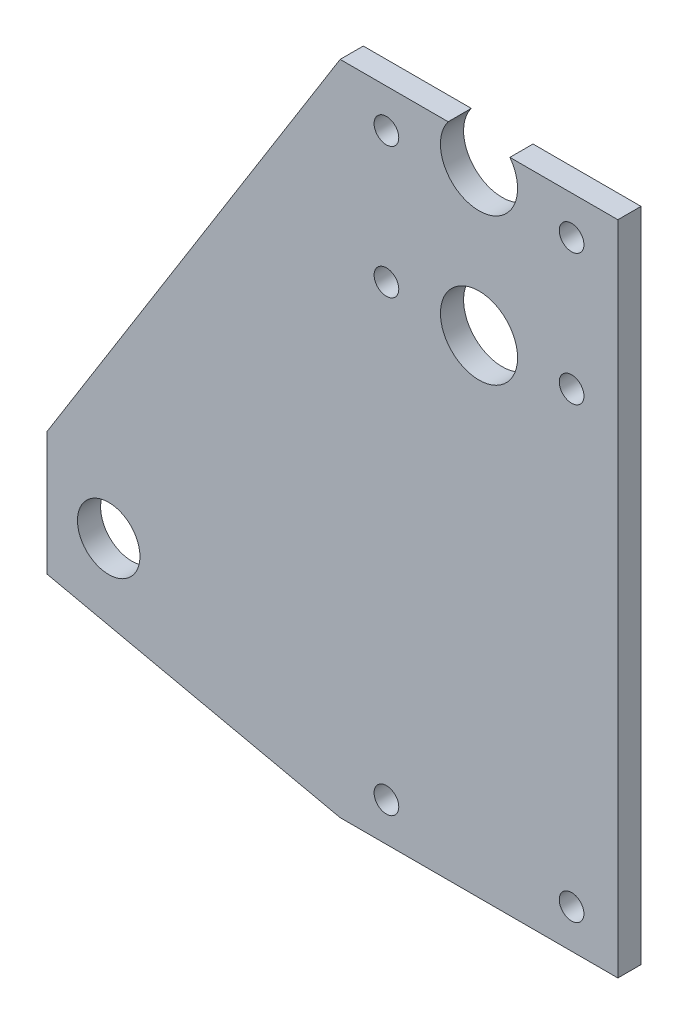
ISO-10303-21;
HEADER;
FILE_DESCRIPTION(('STEP AP214'),'2;1');
FILE_NAME('part.step','',(''),(''),'','','');
FILE_SCHEMA(('AUTOMOTIVE_DESIGN { 1 0 10303 214 1 1 1 1 }'));
ENDSEC;
DATA;
#1=APPLICATION_CONTEXT('core data for automotive mechanical design processes');
#2=APPLICATION_PROTOCOL_DEFINITION('international standard','automotive_design',2000,#1);
#3=PRODUCT_CONTEXT('',#1,'mechanical');
#4=PRODUCT('Part','Part','',(#3));
#5=PRODUCT_RELATED_PRODUCT_CATEGORY('part','',(#4));
#6=PRODUCT_DEFINITION_FORMATION('','',#4);
#7=PRODUCT_DEFINITION_CONTEXT('part definition',#1,'design');
#8=PRODUCT_DEFINITION('design','',#6,#7);
#9=PRODUCT_DEFINITION_SHAPE('','',#8);
#10=(LENGTH_UNIT() NAMED_UNIT(*) SI_UNIT(.MILLI.,.METRE.));
#11=(NAMED_UNIT(*) PLANE_ANGLE_UNIT() SI_UNIT($,.RADIAN.));
#12=(NAMED_UNIT(*) SI_UNIT($,.STERADIAN.) SOLID_ANGLE_UNIT());
#13=UNCERTAINTY_MEASURE_WITH_UNIT(LENGTH_MEASURE(1.E-05),#10,'distance_accuracy_value','');
#14=(GEOMETRIC_REPRESENTATION_CONTEXT(3) GLOBAL_UNCERTAINTY_ASSIGNED_CONTEXT((#13)) GLOBAL_UNIT_ASSIGNED_CONTEXT((#10,
#11,#12)) REPRESENTATION_CONTEXT('',''));
#15=CARTESIAN_POINT('',(0.,0.,0.));
#16=DIRECTION('',(0.,0.,1.));
#17=DIRECTION('',(1.,0.,0.));
#18=AXIS2_PLACEMENT_3D('',#15,#16,#17);
#19=CARTESIAN_POINT('',(56.,95.7795376342654,-3.));
#20=DIRECTION('',(0.,0.,1.));
#21=DIRECTION('',(1.,0.,0.));
#22=AXIS2_PLACEMENT_3D('',#19,#20,#21);
#23=CYLINDRICAL_SURFACE('',#22,5.);
#24=CARTESIAN_POINT('',(56.,95.7795376342654,0.));
#25=DIRECTION('',(0.,0.,1.));
#26=DIRECTION('',(1.,0.,0.));
#27=AXIS2_PLACEMENT_3D('',#24,#25,#26);
#28=CIRCLE('',#27,5.);
#29=CARTESIAN_POINT('',(52.,98.7795376342654,0.));
#30=VERTEX_POINT('',#29);
#31=CARTESIAN_POINT('',(60.,98.7795376342654,0.));
#32=VERTEX_POINT('',#31);
#33=EDGE_CURVE('E159',#30,#32,#28,.T.);
#34=ORIENTED_EDGE('',*,*,#33,.T.);
#35=DIRECTION('',(0.,0.,1.));
#36=VECTOR('',#35,1.);
#37=CARTESIAN_POINT('',(60.,98.7795376342654,-3.));
#38=LINE('',#37,#36);
#39=CARTESIAN_POINT('',(60.,98.7795376342654,-3.));
#40=VERTEX_POINT('',#39);
#41=EDGE_CURVE('E11',#40,#32,#38,.T.);
#42=ORIENTED_EDGE('',*,*,#41,.F.);
#43=CARTESIAN_POINT('',(56.,95.7795376342654,-3.));
#44=DIRECTION('',(0.,0.,1.));
#45=DIRECTION('',(1.,0.,0.));
#46=AXIS2_PLACEMENT_3D('',#43,#44,#45);
#47=CIRCLE('',#46,5.);
#48=CARTESIAN_POINT('',(52.,98.7795376342654,-3.));
#49=VERTEX_POINT('',#48);
#50=EDGE_CURVE('E56',#49,#40,#47,.T.);
#51=ORIENTED_EDGE('',*,*,#50,.F.);
#52=DIRECTION('',(0.,0.,1.));
#53=VECTOR('',#52,1.);
#54=CARTESIAN_POINT('',(52.,98.7795376342654,-3.));
#55=LINE('',#54,#53);
#56=EDGE_CURVE('E41',#49,#30,#55,.T.);
#57=ORIENTED_EDGE('',*,*,#56,.T.);
#58=EDGE_LOOP('',(#34,#42,#51,#57));
#59=FACE_BOUND('',#58,.T.);
#60=ADVANCED_FACE('F37',(#59),#23,.F.);
#61=CARTESIAN_POINT('',(0.,98.7795376342654,-3.));
#62=DIRECTION('',(0.,1.,0.));
#63=DIRECTION('',(0.,0.,1.));
#64=AXIS2_PLACEMENT_3D('',#61,#62,#63);
#65=PLANE('',#64);
#66=DIRECTION('',(-1.,0.,0.));
#67=VECTOR('',#66,1.);
#68=CARTESIAN_POINT('',(0.,98.7795376342654,0.));
#69=LINE('',#68,#67);
#70=CARTESIAN_POINT('',(74.,98.7795376342654,0.));
#71=VERTEX_POINT('',#70);
#72=EDGE_CURVE('E165',#71,#32,#69,.T.);
#73=ORIENTED_EDGE('',*,*,#72,.F.);
#74=DIRECTION('',(0.,0.,1.));
#75=VECTOR('',#74,1.);
#76=CARTESIAN_POINT('',(74.,98.7795376342654,-3.));
#77=LINE('',#76,#75);
#78=CARTESIAN_POINT('',(74.,98.7795376342654,-3.));
#79=VERTEX_POINT('',#78);
#80=EDGE_CURVE('E47',#79,#71,#77,.T.);
#81=ORIENTED_EDGE('',*,*,#80,.F.);
#82=DIRECTION('',(-1.,0.,0.));
#83=VECTOR('',#82,1.);
#84=CARTESIAN_POINT('',(0.,98.7795376342654,-3.));
#85=LINE('',#84,#83);
#86=EDGE_CURVE('E126',#79,#40,#85,.T.);
#87=ORIENTED_EDGE('',*,*,#86,.T.);
#88=ORIENTED_EDGE('',*,*,#41,.T.);
#89=EDGE_LOOP('',(#73,#81,#87,#88));
#90=FACE_BOUND('',#89,.T.);
#91=ADVANCED_FACE('F216',(#90),#65,.T.);
#92=CARTESIAN_POINT('',(74.,0.,-3.));
#93=DIRECTION('',(1.,0.,0.));
#94=DIRECTION('',(0.,1.,0.));
#95=AXIS2_PLACEMENT_3D('',#92,#93,#94);
#96=PLANE('',#95);
#97=DIRECTION('',(0.,1.,0.));
#98=VECTOR('',#97,1.);
#99=CARTESIAN_POINT('',(74.,0.,0.));
#100=LINE('',#99,#98);
#101=CARTESIAN_POINT('',(74.,13.6572243798793,0.));
#102=VERTEX_POINT('',#101);
#103=EDGE_CURVE('E113',#102,#71,#100,.T.);
#104=ORIENTED_EDGE('',*,*,#103,.F.);
#105=DIRECTION('',(0.,0.,1.));
#106=VECTOR('',#105,1.);
#107=CARTESIAN_POINT('',(74.,13.6572243798793,-3.));
#108=LINE('',#107,#106);
#109=CARTESIAN_POINT('',(74.,13.6572243798793,-3.));
#110=VERTEX_POINT('',#109);
#111=EDGE_CURVE('E109',#110,#102,#108,.T.);
#112=ORIENTED_EDGE('',*,*,#111,.F.);
#113=DIRECTION('',(0.,1.,0.));
#114=VECTOR('',#113,1.);
#115=CARTESIAN_POINT('',(74.,0.,-3.));
#116=LINE('',#115,#114);
#117=EDGE_CURVE('E112',#110,#79,#116,.T.);
#118=ORIENTED_EDGE('',*,*,#117,.T.);
#119=ORIENTED_EDGE('',*,*,#80,.T.);
#120=EDGE_LOOP('',(#104,#112,#118,#119));
#121=FACE_BOUND('',#120,.T.);
#122=ADVANCED_FACE('F111',(#121),#96,.T.);
#123=CARTESIAN_POINT('',(0.,13.6572243798793,-3.));
#124=DIRECTION('',(0.,-1.,0.));
#125=DIRECTION('',(0.,0.,-1.));
#126=AXIS2_PLACEMENT_3D('',#123,#124,#125);
#127=PLANE('',#126);
#128=DIRECTION('',(1.,0.,0.));
#129=VECTOR('',#128,1.);
#130=CARTESIAN_POINT('',(0.,13.6572243798793,0.));
#131=LINE('',#130,#129);
#132=CARTESIAN_POINT('',(38.,13.6572243798794,0.));
#133=VERTEX_POINT('',#132);
#134=EDGE_CURVE('E174',#133,#102,#131,.T.);
#135=ORIENTED_EDGE('',*,*,#134,.F.);
#136=DIRECTION('',(0.,0.,1.));
#137=VECTOR('',#136,1.);
#138=CARTESIAN_POINT('',(38.,13.6572243798794,-3.));
#139=LINE('',#138,#137);
#140=CARTESIAN_POINT('',(38.,13.6572243798794,-3.));
#141=VERTEX_POINT('',#140);
#142=EDGE_CURVE('E118',#141,#133,#139,.T.);
#143=ORIENTED_EDGE('',*,*,#142,.F.);
#144=DIRECTION('',(1.,0.,0.));
#145=VECTOR('',#144,1.);
#146=CARTESIAN_POINT('',(0.,13.6572243798793,-3.));
#147=LINE('',#146,#145);
#148=EDGE_CURVE('E124',#141,#110,#147,.T.);
#149=ORIENTED_EDGE('',*,*,#148,.T.);
#150=ORIENTED_EDGE('',*,*,#111,.T.);
#151=EDGE_LOOP('',(#135,#143,#149,#150));
#152=FACE_BOUND('',#151,.T.);
#153=ADVANCED_FACE('F128',(#152),#127,.T.);
#154=CARTESIAN_POINT('',(4.60792259520918,20.9883456766654,-3.));
#155=DIRECTION('',(-0.214439472635752,-0.976737279198301,0.));
#156=DIRECTION('',(0.976737279198302,-0.214439472635752,0.));
#157=AXIS2_PLACEMENT_3D('',#154,#155,#156);
#158=PLANE('',#157);
#159=DIRECTION('',(0.976737279198302,-0.214439472635752,0.));
#160=VECTOR('',#159,1.);
#161=CARTESIAN_POINT('',(4.60792259520918,20.9883456766654,0.));
#162=LINE('',#161,#160);
#163=CARTESIAN_POINT('',(0.,22.,0.));
#164=VERTEX_POINT('',#163);
#165=EDGE_CURVE('E171',#164,#133,#162,.T.);
#166=ORIENTED_EDGE('',*,*,#165,.F.);
#167=DIRECTION('',(0.,0.,1.));
#168=VECTOR('',#167,1.);
#169=CARTESIAN_POINT('',(0.,22.,-3.));
#170=LINE('',#169,#168);
#171=CARTESIAN_POINT('',(0.,22.,-3.));
#172=VERTEX_POINT('',#171);
#173=EDGE_CURVE('E201',#172,#164,#170,.T.);
#174=ORIENTED_EDGE('',*,*,#173,.F.);
#175=DIRECTION('',(0.976737279198302,-0.214439472635752,0.));
#176=VECTOR('',#175,1.);
#177=CARTESIAN_POINT('',(4.60792259520918,20.9883456766654,-3.));
#178=LINE('',#177,#176);
#179=EDGE_CURVE('E129',#172,#141,#178,.T.);
#180=ORIENTED_EDGE('',*,*,#179,.T.);
#181=ORIENTED_EDGE('',*,*,#142,.T.);
#182=EDGE_LOOP('',(#166,#174,#180,#181));
#183=FACE_BOUND('',#182,.T.);
#184=ADVANCED_FACE('F240',(#183),#158,.T.);
#185=CARTESIAN_POINT('',(0.,0.,-3.));
#186=DIRECTION('',(-1.,0.,0.));
#187=DIRECTION('',(0.,0.,1.));
#188=AXIS2_PLACEMENT_3D('',#185,#186,#187);
#189=PLANE('',#188);
#190=DIRECTION('',(0.,-1.,0.));
#191=VECTOR('',#190,1.);
#192=CARTESIAN_POINT('',(0.,0.,0.));
#193=LINE('',#192,#191);
#194=CARTESIAN_POINT('',(0.,38.,0.));
#195=VERTEX_POINT('',#194);
#196=EDGE_CURVE('E168',#195,#164,#193,.T.);
#197=ORIENTED_EDGE('',*,*,#196,.F.);
#198=DIRECTION('',(0.,0.,1.));
#199=VECTOR('',#198,1.);
#200=CARTESIAN_POINT('',(0.,38.,-3.));
#201=LINE('',#200,#199);
#202=CARTESIAN_POINT('',(0.,38.,-3.));
#203=VERTEX_POINT('',#202);
#204=EDGE_CURVE('E203',#203,#195,#201,.T.);
#205=ORIENTED_EDGE('',*,*,#204,.F.);
#206=DIRECTION('',(0.,-1.,0.));
#207=VECTOR('',#206,1.);
#208=CARTESIAN_POINT('',(0.,0.,-3.));
#209=LINE('',#208,#207);
#210=EDGE_CURVE('E131',#203,#172,#209,.T.);
#211=ORIENTED_EDGE('',*,*,#210,.T.);
#212=ORIENTED_EDGE('',*,*,#173,.T.);
#213=EDGE_LOOP('',(#197,#205,#211,#212));
#214=FACE_BOUND('',#213,.T.);
#215=ADVANCED_FACE('F236',(#214),#189,.T.);
#216=CARTESIAN_POINT('',(-17.0811702363908,10.6793255468419,-3.));
#217=DIRECTION('',(-0.847918107595521,0.53012723266366,0.));
#218=DIRECTION('',(-0.53012723266366,-0.847918107595521,0.));
#219=AXIS2_PLACEMENT_3D('',#216,#217,#218);
#220=PLANE('',#219);
#221=DIRECTION('',(-0.53012723266366,-0.847918107595521,0.));
#222=VECTOR('',#221,1.);
#223=CARTESIAN_POINT('',(-17.0811702363908,10.6793255468419,0.));
#224=LINE('',#223,#222);
#225=CARTESIAN_POINT('',(38.,98.7795376342654,0.));
#226=VERTEX_POINT('',#225);
#227=EDGE_CURVE('E164',#226,#195,#224,.T.);
#228=ORIENTED_EDGE('',*,*,#227,.F.);
#229=DIRECTION('',(0.,0.,1.));
#230=VECTOR('',#229,1.);
#231=CARTESIAN_POINT('',(38.,98.7795376342654,-3.));
#232=LINE('',#231,#230);
#233=CARTESIAN_POINT('',(38.,98.7795376342654,-3.));
#234=VERTEX_POINT('',#233);
#235=EDGE_CURVE('E204',#234,#226,#232,.T.);
#236=ORIENTED_EDGE('',*,*,#235,.F.);
#237=DIRECTION('',(-0.53012723266366,-0.847918107595521,0.));
#238=VECTOR('',#237,1.);
#239=CARTESIAN_POINT('',(-17.0811702363908,10.6793255468419,-3.));
#240=LINE('',#239,#238);
#241=EDGE_CURVE('E423',#234,#203,#240,.T.);
#242=ORIENTED_EDGE('',*,*,#241,.T.);
#243=ORIENTED_EDGE('',*,*,#204,.T.);
#244=EDGE_LOOP('',(#228,#236,#242,#243));
#245=FACE_BOUND('',#244,.T.);
#246=ADVANCED_FACE('F232',(#245),#220,.T.);
#247=CARTESIAN_POINT('',(68.,76.7795376342653,-3.));
#248=DIRECTION('',(0.,0.,1.));
#249=DIRECTION('',(1.,0.,0.));
#250=AXIS2_PLACEMENT_3D('',#247,#248,#249);
#251=CYLINDRICAL_SURFACE('',#250,1.60000000000001);
#252=CARTESIAN_POINT('',(68.,76.7795376342653,-3.));
#253=DIRECTION('',(0.,0.,1.));
#254=DIRECTION('',(1.,0.,0.));
#255=AXIS2_PLACEMENT_3D('',#252,#253,#254);
#256=CIRCLE('',#255,1.60000000000001);
#257=CARTESIAN_POINT('',(69.6,76.7795376342653,-3.));
#258=VERTEX_POINT('',#257);
#259=EDGE_CURVE('E150',#258,#258,#256,.T.);
#260=ORIENTED_EDGE('',*,*,#259,.F.);
#261=EDGE_LOOP('',(#260));
#262=FACE_BOUND('',#261,.T.);
#263=CARTESIAN_POINT('',(68.,76.7795376342653,0.));
#264=DIRECTION('',(0.,0.,1.));
#265=DIRECTION('',(1.,0.,0.));
#266=AXIS2_PLACEMENT_3D('',#263,#264,#265);
#267=CIRCLE('',#266,1.60000000000001);
#268=CARTESIAN_POINT('',(69.6,76.7795376342653,0.));
#269=VERTEX_POINT('',#268);
#270=EDGE_CURVE('E192',#269,#269,#267,.T.);
#271=ORIENTED_EDGE('',*,*,#270,.T.);
#272=EDGE_LOOP('',(#271));
#273=FACE_BOUND('',#272,.T.);
#274=ADVANCED_FACE('F235',(#262,#273),#251,.F.);
#275=CARTESIAN_POINT('',(44.,93.7795376342653,-3.));
#276=DIRECTION('',(0.,0.,1.));
#277=DIRECTION('',(1.,0.,0.));
#278=AXIS2_PLACEMENT_3D('',#275,#276,#277);
#279=CYLINDRICAL_SURFACE('',#278,1.6);
#280=CARTESIAN_POINT('',(44.,93.7795376342653,-3.));
#281=DIRECTION('',(0.,0.,1.));
#282=DIRECTION('',(1.,0.,0.));
#283=AXIS2_PLACEMENT_3D('',#280,#281,#282);
#284=CIRCLE('',#283,1.6);
#285=CARTESIAN_POINT('',(45.6,93.7795376342653,-3.));
#286=VERTEX_POINT('',#285);
#287=EDGE_CURVE('E147',#286,#286,#284,.T.);
#288=ORIENTED_EDGE('',*,*,#287,.F.);
#289=EDGE_LOOP('',(#288));
#290=FACE_BOUND('',#289,.T.);
#291=CARTESIAN_POINT('',(44.,93.7795376342653,0.));
#292=DIRECTION('',(0.,0.,1.));
#293=DIRECTION('',(1.,0.,0.));
#294=AXIS2_PLACEMENT_3D('',#291,#292,#293);
#295=CIRCLE('',#294,1.6);
#296=CARTESIAN_POINT('',(45.6,93.7795376342653,0.));
#297=VERTEX_POINT('',#296);
#298=EDGE_CURVE('E189',#297,#297,#295,.T.);
#299=ORIENTED_EDGE('',*,*,#298,.T.);
#300=EDGE_LOOP('',(#299));
#301=FACE_BOUND('',#300,.T.);
#302=ADVANCED_FACE('F273',(#290,#301),#279,.F.);
#303=CARTESIAN_POINT('',(44.,76.7795376342653,-3.));
#304=DIRECTION('',(0.,0.,1.));
#305=DIRECTION('',(1.,0.,0.));
#306=AXIS2_PLACEMENT_3D('',#303,#304,#305);
#307=CYLINDRICAL_SURFACE('',#306,1.6);
#308=CARTESIAN_POINT('',(44.,76.7795376342653,-3.));
#309=DIRECTION('',(0.,0.,1.));
#310=DIRECTION('',(1.,0.,0.));
#311=AXIS2_PLACEMENT_3D('',#308,#309,#310);
#312=CIRCLE('',#311,1.6);
#313=CARTESIAN_POINT('',(45.6,76.7795376342653,-3.));
#314=VERTEX_POINT('',#313);
#315=EDGE_CURVE('E144',#314,#314,#312,.T.);
#316=ORIENTED_EDGE('',*,*,#315,.F.);
#317=EDGE_LOOP('',(#316));
#318=FACE_BOUND('',#317,.T.);
#319=CARTESIAN_POINT('',(44.,76.7795376342653,0.));
#320=DIRECTION('',(0.,0.,1.));
#321=DIRECTION('',(1.,0.,0.));
#322=AXIS2_PLACEMENT_3D('',#319,#320,#321);
#323=CIRCLE('',#322,1.6);
#324=CARTESIAN_POINT('',(45.6,76.7795376342653,0.));
#325=VERTEX_POINT('',#324);
#326=EDGE_CURVE('E186',#325,#325,#323,.T.);
#327=ORIENTED_EDGE('',*,*,#326,.T.);
#328=EDGE_LOOP('',(#327));
#329=FACE_BOUND('',#328,.T.);
#330=ADVANCED_FACE('F281',(#318,#329),#307,.F.);
#331=CARTESIAN_POINT('',(68.,18.6572243798793,-3.));
#332=DIRECTION('',(0.,0.,1.));
#333=DIRECTION('',(1.,0.,0.));
#334=AXIS2_PLACEMENT_3D('',#331,#332,#333);
#335=CYLINDRICAL_SURFACE('',#334,1.6);
#336=CARTESIAN_POINT('',(68.,18.6572243798793,-3.));
#337=DIRECTION('',(0.,0.,1.));
#338=DIRECTION('',(1.,0.,0.));
#339=AXIS2_PLACEMENT_3D('',#336,#337,#338);
#340=CIRCLE('',#339,1.6);
#341=CARTESIAN_POINT('',(69.6,18.6572243798793,-3.));
#342=VERTEX_POINT('',#341);
#343=EDGE_CURVE('E141',#342,#342,#340,.T.);
#344=ORIENTED_EDGE('',*,*,#343,.F.);
#345=EDGE_LOOP('',(#344));
#346=FACE_BOUND('',#345,.T.);
#347=CARTESIAN_POINT('',(68.,18.6572243798793,0.));
#348=DIRECTION('',(0.,0.,1.));
#349=DIRECTION('',(1.,0.,0.));
#350=AXIS2_PLACEMENT_3D('',#347,#348,#349);
#351=CIRCLE('',#350,1.6);
#352=CARTESIAN_POINT('',(69.6,18.6572243798793,0.));
#353=VERTEX_POINT('',#352);
#354=EDGE_CURVE('E183',#353,#353,#351,.T.);
#355=ORIENTED_EDGE('',*,*,#354,.T.);
#356=EDGE_LOOP('',(#355));
#357=FACE_BOUND('',#356,.T.);
#358=ADVANCED_FACE('F289',(#346,#357),#335,.F.);
#359=CARTESIAN_POINT('',(44.,18.6572243798793,-3.));
#360=DIRECTION('',(0.,0.,1.));
#361=DIRECTION('',(1.,0.,0.));
#362=AXIS2_PLACEMENT_3D('',#359,#360,#361);
#363=CYLINDRICAL_SURFACE('',#362,1.6);
#364=CARTESIAN_POINT('',(44.,18.6572243798793,-3.));
#365=DIRECTION('',(0.,0.,1.));
#366=DIRECTION('',(1.,0.,0.));
#367=AXIS2_PLACEMENT_3D('',#364,#365,#366);
#368=CIRCLE('',#367,1.6);
#369=CARTESIAN_POINT('',(45.6,18.6572243798793,-3.));
#370=VERTEX_POINT('',#369);
#371=EDGE_CURVE('E138',#370,#370,#368,.T.);
#372=ORIENTED_EDGE('',*,*,#371,.F.);
#373=EDGE_LOOP('',(#372));
#374=FACE_BOUND('',#373,.T.);
#375=CARTESIAN_POINT('',(44.,18.6572243798793,0.));
#376=DIRECTION('',(0.,0.,1.));
#377=DIRECTION('',(1.,0.,0.));
#378=AXIS2_PLACEMENT_3D('',#375,#376,#377);
#379=CIRCLE('',#378,1.6);
#380=CARTESIAN_POINT('',(45.6,18.6572243798793,0.));
#381=VERTEX_POINT('',#380);
#382=EDGE_CURVE('E180',#381,#381,#379,.T.);
#383=ORIENTED_EDGE('',*,*,#382,.T.);
#384=EDGE_LOOP('',(#383));
#385=FACE_BOUND('',#384,.T.);
#386=ADVANCED_FACE('F223',(#374,#385),#363,.F.);
#387=CARTESIAN_POINT('',(7.99999999999999,30.,-3.));
#388=DIRECTION('',(0.,0.,1.));
#389=DIRECTION('',(1.,0.,0.));
#390=AXIS2_PLACEMENT_3D('',#387,#388,#389);
#391=CYLINDRICAL_SURFACE('',#390,4.05);
#392=CARTESIAN_POINT('',(7.99999999999999,30.,-3.));
#393=DIRECTION('',(0.,0.,1.));
#394=DIRECTION('',(1.,0.,0.));
#395=AXIS2_PLACEMENT_3D('',#392,#393,#394);
#396=CIRCLE('',#395,4.05);
#397=CARTESIAN_POINT('',(12.05,30.,-3.));
#398=VERTEX_POINT('',#397);
#399=EDGE_CURVE('E135',#398,#398,#396,.T.);
#400=ORIENTED_EDGE('',*,*,#399,.F.);
#401=EDGE_LOOP('',(#400));
#402=FACE_BOUND('',#401,.T.);
#403=CARTESIAN_POINT('',(7.99999999999999,30.,0.));
#404=DIRECTION('',(0.,0.,1.));
#405=DIRECTION('',(1.,0.,0.));
#406=AXIS2_PLACEMENT_3D('',#403,#404,#405);
#407=CIRCLE('',#406,4.05);
#408=CARTESIAN_POINT('',(12.05,30.,0.));
#409=VERTEX_POINT('',#408);
#410=EDGE_CURVE('E177',#409,#409,#407,.T.);
#411=ORIENTED_EDGE('',*,*,#410,.T.);
#412=EDGE_LOOP('',(#411));
#413=FACE_BOUND('',#412,.T.);
#414=ADVANCED_FACE('F214',(#402,#413),#391,.F.);
#415=EDGE_CURVE('E161',#30,#226,#69,.T.);
#416=ORIENTED_EDGE('',*,*,#415,.F.);
#417=ORIENTED_EDGE('',*,*,#56,.F.);
#418=EDGE_CURVE('E419',#49,#234,#85,.T.);
#419=ORIENTED_EDGE('',*,*,#418,.T.);
#420=ORIENTED_EDGE('',*,*,#235,.T.);
#421=EDGE_LOOP('',(#416,#417,#419,#420));
#422=FACE_BOUND('',#421,.T.);
#423=ADVANCED_FACE('F212',(#422),#65,.T.);
#424=CARTESIAN_POINT('',(56.,76.7795376342654,-3.));
#425=DIRECTION('',(0.,0.,1.));
#426=DIRECTION('',(1.,0.,0.));
#427=AXIS2_PLACEMENT_3D('',#424,#425,#426);
#428=CYLINDRICAL_SURFACE('',#427,5.);
#429=CARTESIAN_POINT('',(56.,76.7795376342654,-3.));
#430=DIRECTION('',(0.,0.,1.));
#431=DIRECTION('',(1.,0.,0.));
#432=AXIS2_PLACEMENT_3D('',#429,#430,#431);
#433=CIRCLE('',#432,5.);
#434=CARTESIAN_POINT('',(61.,76.7795376342654,-3.));
#435=VERTEX_POINT('',#434);
#436=EDGE_CURVE('E197',#435,#435,#433,.T.);
#437=ORIENTED_EDGE('',*,*,#436,.F.);
#438=EDGE_LOOP('',(#437));
#439=FACE_BOUND('',#438,.T.);
#440=CARTESIAN_POINT('',(56.,76.7795376342654,0.));
#441=DIRECTION('',(0.,0.,1.));
#442=DIRECTION('',(1.,0.,0.));
#443=AXIS2_PLACEMENT_3D('',#440,#441,#442);
#444=CIRCLE('',#443,5.);
#445=CARTESIAN_POINT('',(61.,76.7795376342654,0.));
#446=VERTEX_POINT('',#445);
#447=EDGE_CURVE('E156',#446,#446,#444,.T.);
#448=ORIENTED_EDGE('',*,*,#447,.T.);
#449=EDGE_LOOP('',(#448));
#450=FACE_BOUND('',#449,.T.);
#451=ADVANCED_FACE('F39',(#439,#450),#428,.F.);
#452=CARTESIAN_POINT('',(68.,93.7795376342653,-3.));
#453=DIRECTION('',(0.,0.,1.));
#454=DIRECTION('',(1.,0.,0.));
#455=AXIS2_PLACEMENT_3D('',#452,#453,#454);
#456=CYLINDRICAL_SURFACE('',#455,1.60000000000001);
#457=CARTESIAN_POINT('',(68.,93.7795376342653,-3.));
#458=DIRECTION('',(0.,0.,1.));
#459=DIRECTION('',(1.,0.,0.));
#460=AXIS2_PLACEMENT_3D('',#457,#458,#459);
#461=CIRCLE('',#460,1.60000000000001);
#462=CARTESIAN_POINT('',(69.6,93.7795376342653,-3.));
#463=VERTEX_POINT('',#462);
#464=EDGE_CURVE('E153',#463,#463,#461,.T.);
#465=ORIENTED_EDGE('',*,*,#464,.F.);
#466=EDGE_LOOP('',(#465));
#467=FACE_BOUND('',#466,.T.);
#468=CARTESIAN_POINT('',(68.,93.7795376342653,0.));
#469=DIRECTION('',(0.,0.,1.));
#470=DIRECTION('',(1.,0.,0.));
#471=AXIS2_PLACEMENT_3D('',#468,#469,#470);
#472=CIRCLE('',#471,1.60000000000001);
#473=CARTESIAN_POINT('',(69.6,93.7795376342653,0.));
#474=VERTEX_POINT('',#473);
#475=EDGE_CURVE('E195',#474,#474,#472,.T.);
#476=ORIENTED_EDGE('',*,*,#475,.T.);
#477=EDGE_LOOP('',(#476));
#478=FACE_BOUND('',#477,.T.);
#479=ADVANCED_FACE('F221',(#467,#478),#456,.F.);
#480=CARTESIAN_POINT('',(0.,0.,-3.));
#481=DIRECTION('',(0.,0.,1.));
#482=DIRECTION('',(1.,0.,0.));
#483=AXIS2_PLACEMENT_3D('',#480,#481,#482);
#484=PLANE('',#483);
#485=ORIENTED_EDGE('',*,*,#436,.T.);
#486=EDGE_LOOP('',(#485));
#487=FACE_BOUND('',#486,.T.);
#488=ORIENTED_EDGE('',*,*,#50,.T.);
#489=ORIENTED_EDGE('',*,*,#86,.F.);
#490=ORIENTED_EDGE('',*,*,#117,.F.);
#491=ORIENTED_EDGE('',*,*,#148,.F.);
#492=ORIENTED_EDGE('',*,*,#179,.F.);
#493=ORIENTED_EDGE('',*,*,#210,.F.);
#494=ORIENTED_EDGE('',*,*,#241,.F.);
#495=ORIENTED_EDGE('',*,*,#418,.F.);
#496=EDGE_LOOP('',(#488,#489,#490,#491,#492,#493,#494,#495));
#497=FACE_BOUND('',#496,.T.);
#498=ORIENTED_EDGE('',*,*,#399,.T.);
#499=EDGE_LOOP('',(#498));
#500=FACE_BOUND('',#499,.T.);
#501=ORIENTED_EDGE('',*,*,#371,.T.);
#502=EDGE_LOOP('',(#501));
#503=FACE_BOUND('',#502,.T.);
#504=ORIENTED_EDGE('',*,*,#343,.T.);
#505=EDGE_LOOP('',(#504));
#506=FACE_BOUND('',#505,.T.);
#507=ORIENTED_EDGE('',*,*,#315,.T.);
#508=EDGE_LOOP('',(#507));
#509=FACE_BOUND('',#508,.T.);
#510=ORIENTED_EDGE('',*,*,#287,.T.);
#511=EDGE_LOOP('',(#510));
#512=FACE_BOUND('',#511,.T.);
#513=ORIENTED_EDGE('',*,*,#259,.T.);
#514=EDGE_LOOP('',(#513));
#515=FACE_BOUND('',#514,.T.);
#516=ORIENTED_EDGE('',*,*,#464,.T.);
#517=EDGE_LOOP('',(#516));
#518=FACE_BOUND('',#517,.T.);
#519=ADVANCED_FACE('F121',(#487,#497,#500,#503,#506,#509,#512,#515,#518),#484,.F.);
#520=CARTESIAN_POINT('',(0.,0.,0.));
#521=DIRECTION('',(0.,0.,1.));
#522=DIRECTION('',(1.,0.,0.));
#523=AXIS2_PLACEMENT_3D('',#520,#521,#522);
#524=PLANE('',#523);
#525=ORIENTED_EDGE('',*,*,#447,.F.);
#526=EDGE_LOOP('',(#525));
#527=FACE_BOUND('',#526,.T.);
#528=ORIENTED_EDGE('',*,*,#33,.F.);
#529=ORIENTED_EDGE('',*,*,#415,.T.);
#530=ORIENTED_EDGE('',*,*,#227,.T.);
#531=ORIENTED_EDGE('',*,*,#196,.T.);
#532=ORIENTED_EDGE('',*,*,#165,.T.);
#533=ORIENTED_EDGE('',*,*,#134,.T.);
#534=ORIENTED_EDGE('',*,*,#103,.T.);
#535=ORIENTED_EDGE('',*,*,#72,.T.);
#536=EDGE_LOOP('',(#528,#529,#530,#531,#532,#533,#534,#535));
#537=FACE_BOUND('',#536,.T.);
#538=ORIENTED_EDGE('',*,*,#410,.F.);
#539=EDGE_LOOP('',(#538));
#540=FACE_BOUND('',#539,.T.);
#541=ORIENTED_EDGE('',*,*,#382,.F.);
#542=EDGE_LOOP('',(#541));
#543=FACE_BOUND('',#542,.T.);
#544=ORIENTED_EDGE('',*,*,#354,.F.);
#545=EDGE_LOOP('',(#544));
#546=FACE_BOUND('',#545,.T.);
#547=ORIENTED_EDGE('',*,*,#326,.F.);
#548=EDGE_LOOP('',(#547));
#549=FACE_BOUND('',#548,.T.);
#550=ORIENTED_EDGE('',*,*,#298,.F.);
#551=EDGE_LOOP('',(#550));
#552=FACE_BOUND('',#551,.T.);
#553=ORIENTED_EDGE('',*,*,#270,.F.);
#554=EDGE_LOOP('',(#553));
#555=FACE_BOUND('',#554,.T.);
#556=ORIENTED_EDGE('',*,*,#475,.F.);
#557=EDGE_LOOP('',(#556));
#558=FACE_BOUND('',#557,.T.);
#559=ADVANCED_FACE('F210',(#527,#537,#540,#543,#546,#549,#552,#555,#558),#524,.T.);
#560=CLOSED_SHELL('',(#60,#91,#122,#153,#184,#215,#246,#274,#302,#330,#358,#386,#414,#423,#451,
#479,#519,#559));
#561=MANIFOLD_SOLID_BREP('B2',#560);
#562=ADVANCED_BREP_SHAPE_REPRESENTATION('',(#18,#561),#14);
#563=SHAPE_DEFINITION_REPRESENTATION(#9,#562);
ENDSEC;
END-ISO-10303-21;
